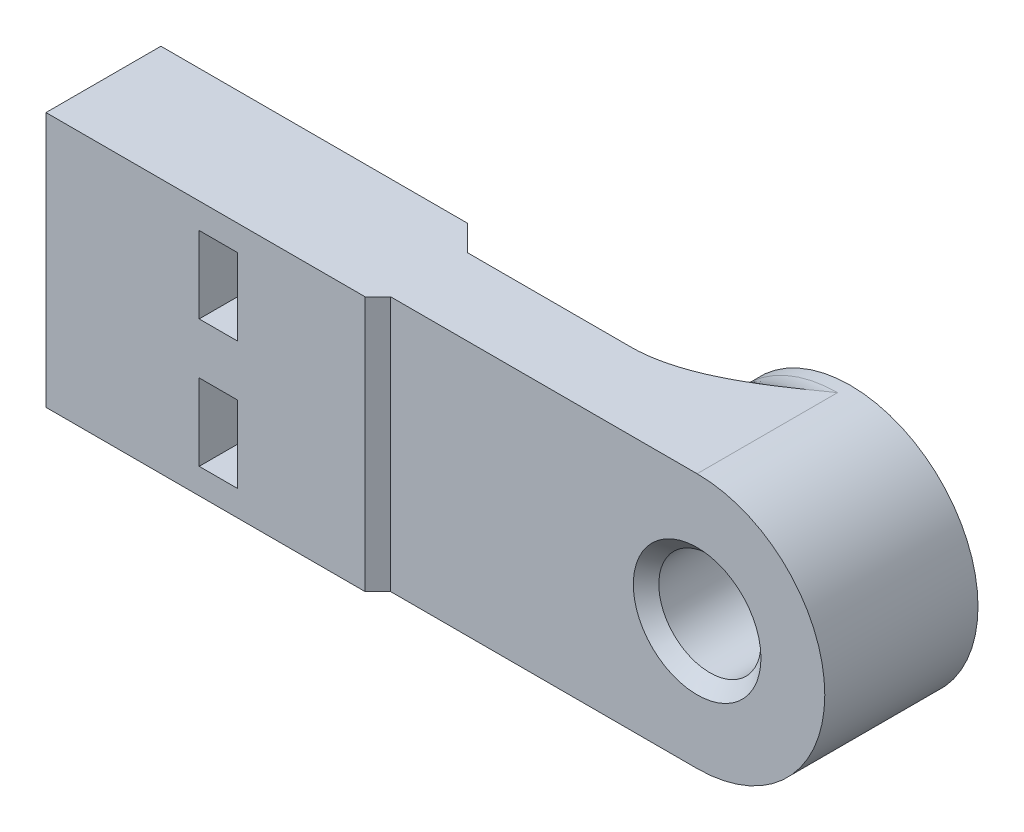
ISO-10303-21;
HEADER;
FILE_DESCRIPTION(('STEP AP214'),'2;1');
FILE_NAME('part.step','',(''),(''),'','','');
FILE_SCHEMA(('AUTOMOTIVE_DESIGN { 1 0 10303 214 1 1 1 1 }'));
ENDSEC;
DATA;
#1=APPLICATION_CONTEXT('core data for automotive mechanical design processes');
#2=APPLICATION_PROTOCOL_DEFINITION('international standard','automotive_design',2000,#1);
#3=PRODUCT_CONTEXT('',#1,'mechanical');
#4=PRODUCT('Part','Part','',(#3));
#5=PRODUCT_RELATED_PRODUCT_CATEGORY('part','',(#4));
#6=PRODUCT_DEFINITION_FORMATION('','',#4);
#7=PRODUCT_DEFINITION_CONTEXT('part definition',#1,'design');
#8=PRODUCT_DEFINITION('design','',#6,#7);
#9=PRODUCT_DEFINITION_SHAPE('','',#8);
#10=(LENGTH_UNIT() NAMED_UNIT(*) SI_UNIT(.MILLI.,.METRE.));
#11=(NAMED_UNIT(*) PLANE_ANGLE_UNIT() SI_UNIT($,.RADIAN.));
#12=(NAMED_UNIT(*) SI_UNIT($,.STERADIAN.) SOLID_ANGLE_UNIT());
#13=UNCERTAINTY_MEASURE_WITH_UNIT(LENGTH_MEASURE(1.E-05),#10,'distance_accuracy_value','');
#14=(GEOMETRIC_REPRESENTATION_CONTEXT(3) GLOBAL_UNCERTAINTY_ASSIGNED_CONTEXT((#13)) GLOBAL_UNIT_ASSIGNED_CONTEXT((#10,
#11,#12)) REPRESENTATION_CONTEXT('',''));
#15=CARTESIAN_POINT('',(0.,0.,0.));
#16=DIRECTION('',(0.,0.,1.));
#17=DIRECTION('',(1.,0.,0.));
#18=AXIS2_PLACEMENT_3D('',#15,#16,#17);
#19=CARTESIAN_POINT('',(-30.,5.,2.2));
#20=DIRECTION('',(-1.,0.,0.));
#21=DIRECTION('',(0.,0.,1.));
#22=AXIS2_PLACEMENT_3D('',#19,#20,#21);
#23=CYLINDRICAL_SURFACE('',#22,1.5);
#24=CARTESIAN_POINT('',(-38.,5.,2.2));
#25=DIRECTION('',(-1.,0.,0.));
#26=DIRECTION('',(0.,0.,1.));
#27=AXIS2_PLACEMENT_3D('',#24,#25,#26);
#28=CIRCLE('',#27,1.5);
#29=CARTESIAN_POINT('',(-38.,5.,3.7));
#30=VERTEX_POINT('',#29);
#31=EDGE_CURVE('E209',#30,#30,#28,.F.);
#32=ORIENTED_EDGE('',*,*,#31,.T.);
#33=EDGE_LOOP('',(#32));
#34=FACE_BOUND('',#33,.T.);
#35=CARTESIAN_POINT('',(-50.,5.,2.2));
#36=DIRECTION('',(-1.,0.,0.));
#37=DIRECTION('',(0.,0.,1.));
#38=AXIS2_PLACEMENT_3D('',#35,#36,#37);
#39=CIRCLE('',#38,1.5);
#40=CARTESIAN_POINT('',(-50.,5.,3.7));
#41=VERTEX_POINT('',#40);
#42=EDGE_CURVE('E294',#41,#41,#39,.T.);
#43=ORIENTED_EDGE('',*,*,#42,.T.);
#44=EDGE_LOOP('',(#43));
#45=FACE_BOUND('',#44,.T.);
#46=ADVANCED_FACE('F38',(#34,#45),#23,.F.);
#47=CARTESIAN_POINT('',(-30.,-5.,2.2));
#48=DIRECTION('',(-1.,0.,0.));
#49=DIRECTION('',(0.,0.,1.));
#50=AXIS2_PLACEMENT_3D('',#47,#48,#49);
#51=CYLINDRICAL_SURFACE('',#50,1.5);
#52=CARTESIAN_POINT('',(-38.,-5.,2.2));
#53=DIRECTION('',(-1.,0.,0.));
#54=DIRECTION('',(0.,0.,1.));
#55=AXIS2_PLACEMENT_3D('',#52,#53,#54);
#56=CIRCLE('',#55,1.5);
#57=CARTESIAN_POINT('',(-38.,-5.,3.7));
#58=VERTEX_POINT('',#57);
#59=EDGE_CURVE('E247',#58,#58,#56,.F.);
#60=ORIENTED_EDGE('',*,*,#59,.T.);
#61=EDGE_LOOP('',(#60));
#62=FACE_BOUND('',#61,.T.);
#63=CARTESIAN_POINT('',(-50.,-5.,2.2));
#64=DIRECTION('',(-1.,0.,0.));
#65=DIRECTION('',(0.,0.,1.));
#66=AXIS2_PLACEMENT_3D('',#63,#64,#65);
#67=CIRCLE('',#66,1.5);
#68=CARTESIAN_POINT('',(-50.,-5.,3.7));
#69=VERTEX_POINT('',#68);
#70=EDGE_CURVE('E290',#69,#69,#67,.T.);
#71=ORIENTED_EDGE('',*,*,#70,.T.);
#72=EDGE_LOOP('',(#71));
#73=FACE_BOUND('',#72,.T.);
#74=ADVANCED_FACE('F366',(#62,#73),#51,.F.);
#75=CARTESIAN_POINT('',(0.,0.,6.));
#76=DIRECTION('',(0.,0.,1.));
#77=DIRECTION('',(1.,0.,0.));
#78=AXIS2_PLACEMENT_3D('',#75,#76,#77);
#79=PLANE('',#78);
#80=CARTESIAN_POINT('',(0.,0.,6.));
#81=DIRECTION('',(0.,0.,1.));
#82=DIRECTION('',(1.,0.,0.));
#83=AXIS2_PLACEMENT_3D('',#80,#81,#82);
#84=CIRCLE('',#83,4.99999999999999);
#85=CARTESIAN_POINT('',(4.99999999999999,0.,6.));
#86=VERTEX_POINT('',#85);
#87=EDGE_CURVE('E326',#86,#86,#84,.F.);
#88=ORIENTED_EDGE('',*,*,#87,.T.);
#89=EDGE_LOOP('',(#88));
#90=FACE_BOUND('',#89,.T.);
#91=DIRECTION('',(-1.,0.,0.));
#92=VECTOR('',#91,1.);
#93=CARTESIAN_POINT('',(0.,10.,6.));
#94=LINE('',#93,#92);
#95=CARTESIAN_POINT('',(0.,10.,6.));
#96=VERTEX_POINT('',#95);
#97=CARTESIAN_POINT('',(-24.,10.,6.));
#98=VERTEX_POINT('',#97);
#99=EDGE_CURVE('E309',#96,#98,#94,.T.);
#100=ORIENTED_EDGE('',*,*,#99,.T.);
#101=DIRECTION('',(0.,-1.,0.));
#102=VECTOR('',#101,1.);
#103=CARTESIAN_POINT('',(-24.,10.,6.));
#104=LINE('',#103,#102);
#105=CARTESIAN_POINT('',(-24.,-10.,6.));
#106=VERTEX_POINT('',#105);
#107=EDGE_CURVE('E267',#98,#106,#104,.T.);
#108=ORIENTED_EDGE('',*,*,#107,.T.);
#109=DIRECTION('',(-1.,0.,0.));
#110=VECTOR('',#109,1.);
#111=CARTESIAN_POINT('',(0.,-10.,6.));
#112=LINE('',#111,#110);
#113=CARTESIAN_POINT('',(0.,-10.,6.));
#114=VERTEX_POINT('',#113);
#115=EDGE_CURVE('E303',#114,#106,#112,.T.);
#116=ORIENTED_EDGE('',*,*,#115,.F.);
#117=CARTESIAN_POINT('',(0.,0.,6.));
#118=DIRECTION('',(0.,0.,1.));
#119=DIRECTION('',(1.,0.,0.));
#120=AXIS2_PLACEMENT_3D('',#117,#118,#119);
#121=CIRCLE('',#120,10.);
#122=EDGE_CURVE('E306',#114,#96,#121,.T.);
#123=ORIENTED_EDGE('',*,*,#122,.T.);
#124=EDGE_LOOP('',(#100,#108,#116,#123));
#125=FACE_BOUND('',#124,.T.);
#126=ADVANCED_FACE('F372',(#90,#125),#79,.T.);
#127=CARTESIAN_POINT('',(0.,0.,0.));
#128=DIRECTION('',(0.,0.,1.));
#129=DIRECTION('',(1.,0.,0.));
#130=AXIS2_PLACEMENT_3D('',#127,#128,#129);
#131=PLANE('',#130);
#132=DIRECTION('',(-1.,0.,0.));
#133=VECTOR('',#132,1.);
#134=CARTESIAN_POINT('',(0.,10.,0.));
#135=LINE('',#134,#133);
#136=CARTESIAN_POINT('',(-11.1803398874989,10.,0.));
#137=VERTEX_POINT('',#136);
#138=CARTESIAN_POINT('',(-24.,10.,0.));
#139=VERTEX_POINT('',#138);
#140=EDGE_CURVE('E307',#137,#139,#135,.T.);
#141=ORIENTED_EDGE('',*,*,#140,.F.);
#142=CARTESIAN_POINT('',(0.,0.,0.));
#143=DIRECTION('',(0.,0.,1.));
#144=DIRECTION('',(1.,0.,0.));
#145=AXIS2_PLACEMENT_3D('',#142,#143,#144);
#146=CIRCLE('',#145,15.);
#147=CARTESIAN_POINT('',(-11.1803398874989,-10.,0.));
#148=VERTEX_POINT('',#147);
#149=EDGE_CURVE('E332',#137,#148,#146,.T.);
#150=ORIENTED_EDGE('',*,*,#149,.T.);
#151=DIRECTION('',(-1.,0.,0.));
#152=VECTOR('',#151,1.);
#153=CARTESIAN_POINT('',(0.,-10.,0.));
#154=LINE('',#153,#152);
#155=CARTESIAN_POINT('',(-24.,-10.,0.));
#156=VERTEX_POINT('',#155);
#157=EDGE_CURVE('E300',#148,#156,#154,.T.);
#158=ORIENTED_EDGE('',*,*,#157,.T.);
#159=DIRECTION('',(0.,-1.,0.));
#160=VECTOR('',#159,1.);
#161=CARTESIAN_POINT('',(-24.,10.,0.));
#162=LINE('',#161,#160);
#163=EDGE_CURVE('E278',#139,#156,#162,.T.);
#164=ORIENTED_EDGE('',*,*,#163,.F.);
#165=EDGE_LOOP('',(#141,#150,#158,#164));
#166=FACE_BOUND('',#165,.T.);
#167=ADVANCED_FACE('F350',(#166),#131,.F.);
#168=CARTESIAN_POINT('',(-50.,0.,6.));
#169=DIRECTION('',(1.,0.,0.));
#170=DIRECTION('',(0.,0.,-1.));
#171=AXIS2_PLACEMENT_3D('',#168,#169,#170);
#172=PLANE('',#171);
#173=ORIENTED_EDGE('',*,*,#70,.F.);
#174=EDGE_LOOP('',(#173));
#175=FACE_BOUND('',#174,.T.);
#176=ORIENTED_EDGE('',*,*,#42,.F.);
#177=EDGE_LOOP('',(#176));
#178=FACE_BOUND('',#177,.T.);
#179=DIRECTION('',(0.,0.,-1.));
#180=VECTOR('',#179,1.);
#181=CARTESIAN_POINT('',(-50.,10.,6.));
#182=LINE('',#181,#180);
#183=CARTESIAN_POINT('',(-50.,10.,7.));
#184=VERTEX_POINT('',#183);
#185=CARTESIAN_POINT('',(-50.,10.,-2.));
#186=VERTEX_POINT('',#185);
#187=EDGE_CURVE('E312',#184,#186,#182,.T.);
#188=ORIENTED_EDGE('',*,*,#187,.T.);
#189=DIRECTION('',(0.,-1.,0.));
#190=VECTOR('',#189,1.);
#191=CARTESIAN_POINT('',(-50.,10.,-2.));
#192=LINE('',#191,#190);
#193=CARTESIAN_POINT('',(-50.,-10.,-2.));
#194=VERTEX_POINT('',#193);
#195=EDGE_CURVE('E285',#186,#194,#192,.T.);
#196=ORIENTED_EDGE('',*,*,#195,.T.);
#197=DIRECTION('',(0.,0.,-1.));
#198=VECTOR('',#197,1.);
#199=CARTESIAN_POINT('',(-50.,-10.,6.));
#200=LINE('',#199,#198);
#201=CARTESIAN_POINT('',(-50.,-10.,7.));
#202=VERTEX_POINT('',#201);
#203=EDGE_CURVE('E318',#202,#194,#200,.T.);
#204=ORIENTED_EDGE('',*,*,#203,.F.);
#205=DIRECTION('',(0.,-1.,0.));
#206=VECTOR('',#205,1.);
#207=CARTESIAN_POINT('',(-50.,10.,7.));
#208=LINE('',#207,#206);
#209=EDGE_CURVE('E264',#184,#202,#208,.T.);
#210=ORIENTED_EDGE('',*,*,#209,.F.);
#211=EDGE_LOOP('',(#188,#196,#204,#210));
#212=FACE_BOUND('',#211,.T.);
#213=ADVANCED_FACE('F346',(#175,#178,#212),#172,.F.);
#214=CARTESIAN_POINT('',(0.,-10.,6.));
#215=DIRECTION('',(0.,-1.,0.));
#216=DIRECTION('',(0.,0.,-1.));
#217=AXIS2_PLACEMENT_3D('',#214,#215,#216);
#218=PLANE('',#217);
#219=ORIENTED_EDGE('',*,*,#157,.F.);
#220=CARTESIAN_POINT('',(-11.1803398874989,-10.,0.));
#221=CARTESIAN_POINT('',(-10.8833418810393,-10.,-2.99623992574208E-05));
#222=CARTESIAN_POINT('',(-10.586723603073,-10.,-0.0146927876896592));
#223=CARTESIAN_POINT('',(-9.99650368330956,-10.,-0.0702146909149152));
#224=CARTESIAN_POINT('',(-9.70289720409119,-10.,-0.111021452114292));
#225=CARTESIAN_POINT('',(-8.83797284787217,-10.,-0.266410914239855));
#226=CARTESIAN_POINT('',(-8.27249718229527,-10.,-0.414179804953513));
#227=CARTESIAN_POINT('',(-7.41580997338313,-10.,-0.69554811680268));
#228=CARTESIAN_POINT('',(-7.11620351047926,-10.,-0.80534043107622));
#229=CARTESIAN_POINT('',(-6.52395825241383,-10.,-1.04241229811482));
#230=CARTESIAN_POINT('',(-6.23131919380736,-10.,-1.169691188458));
#231=CARTESIAN_POINT('',(-5.36306780758415,-10.,-1.5738498936846));
#232=CARTESIAN_POINT('',(-4.79777598845155,-10.,-1.87282431176304));
#233=CARTESIAN_POINT('',(-3.68544002130766,-10.,-2.51288014690883));
#234=CARTESIAN_POINT('',(-3.13860738175162,-10.,-2.85431823345776));
#235=CARTESIAN_POINT('',(-2.06078067547005,-10.,-3.56044884205611));
#236=CARTESIAN_POINT('',(-1.52977958409396,-10.,-3.92513081814492));
#237=CARTESIAN_POINT('',(-0.672566535979616,-10.,-4.5244681553936));
#238=CARTESIAN_POINT('',(-0.344440515490625,-10.,-4.75644450116076));
#239=CARTESIAN_POINT('',(-0.0108866222774938,-10.,-4.99230199522322));
#240=CARTESIAN_POINT('',(-0.00544331176374283,-10.,-4.99615099701162));
#241=CARTESIAN_POINT('',(0.,-10.,-5.));
#242=B_SPLINE_CURVE_WITH_KNOTS('',3,(#220,#221,#222,#223,#224,#225,#226,#227,#228,#229,#230,
#231,#232,#233,#234,#235,#236,#237,#238,#239,#240,#241),.UNSPECIFIED.,.F.,.F.,(4,2,2,2,2,2,2,2,
2,2,4),(0.,0.890035292464695,1.77829507120272,3.52501481011828,4.48189649503702,
5.43874194160512,7.35450080314856,9.28760187109383,11.2198320325017,12.4253863415644,
12.4453863415646),.UNSPECIFIED.);
#243=CARTESIAN_POINT('',(0.,-10.,-5.));
#244=VERTEX_POINT('',#243);
#245=EDGE_CURVE('E51',#148,#244,#242,.T.);
#246=ORIENTED_EDGE('',*,*,#245,.T.);
#247=DIRECTION('',(0.,0.,-1.));
#248=VECTOR('',#247,1.);
#249=CARTESIAN_POINT('',(0.,-10.,6.));
#250=LINE('',#249,#248);
#251=EDGE_CURVE('E58',#114,#244,#250,.T.);
#252=ORIENTED_EDGE('',*,*,#251,.F.);
#253=ORIENTED_EDGE('',*,*,#115,.T.);
#254=DIRECTION('',(0.707106781186547,0.,-0.707106781186549));
#255=VECTOR('',#254,1.);
#256=CARTESIAN_POINT('',(-9.00000000000002,-10.,-9.));
#257=LINE('',#256,#255);
#258=CARTESIAN_POINT('',(-25.,-10.,7.));
#259=VERTEX_POINT('',#258);
#260=EDGE_CURVE('E253',#259,#106,#257,.T.);
#261=ORIENTED_EDGE('',*,*,#260,.F.);
#262=DIRECTION('',(1.,0.,0.));
#263=VECTOR('',#262,1.);
#264=CARTESIAN_POINT('',(0.,-10.,7.));
#265=LINE('',#264,#263);
#266=EDGE_CURVE('E257',#202,#259,#265,.T.);
#267=ORIENTED_EDGE('',*,*,#266,.F.);
#268=ORIENTED_EDGE('',*,*,#203,.T.);
#269=DIRECTION('',(1.,0.,0.));
#270=VECTOR('',#269,1.);
#271=CARTESIAN_POINT('',(0.,-10.,-2.));
#272=LINE('',#271,#270);
#273=CARTESIAN_POINT('',(-26.,-10.,-2.));
#274=VERTEX_POINT('',#273);
#275=EDGE_CURVE('E275',#194,#274,#272,.T.);
#276=ORIENTED_EDGE('',*,*,#275,.T.);
#277=DIRECTION('',(0.707106781186551,0.,0.707106781186544));
#278=VECTOR('',#277,1.);
#279=CARTESIAN_POINT('',(-11.9999999999999,-10.,12.));
#280=LINE('',#279,#278);
#281=EDGE_CURVE('E270',#274,#156,#280,.T.);
#282=ORIENTED_EDGE('',*,*,#281,.T.);
#283=EDGE_LOOP('',(#219,#246,#252,#253,#261,#267,#268,#276,#282));
#284=FACE_BOUND('',#283,.T.);
#285=ADVANCED_FACE('F340',(#284),#218,.T.);
#286=CARTESIAN_POINT('',(0.,0.,6.));
#287=DIRECTION('',(0.,0.,-1.));
#288=DIRECTION('',(-1.,0.,0.));
#289=AXIS2_PLACEMENT_3D('',#286,#287,#288);
#290=CYLINDRICAL_SURFACE('',#289,10.);
#291=ORIENTED_EDGE('',*,*,#251,.T.);
#292=CARTESIAN_POINT('',(0.,0.,-5.));
#293=DIRECTION('',(0.,0.,1.));
#294=DIRECTION('',(1.,0.,0.));
#295=AXIS2_PLACEMENT_3D('',#292,#293,#294);
#296=CIRCLE('',#295,10.);
#297=CARTESIAN_POINT('',(0.,10.,-5.));
#298=VERTEX_POINT('',#297);
#299=EDGE_CURVE('E335',#244,#298,#296,.F.);
#300=ORIENTED_EDGE('',*,*,#299,.T.);
#301=DIRECTION('',(0.,0.,-1.));
#302=VECTOR('',#301,1.);
#303=CARTESIAN_POINT('',(0.,10.,6.));
#304=LINE('',#303,#302);
#305=EDGE_CURVE('E65',#96,#298,#304,.T.);
#306=ORIENTED_EDGE('',*,*,#305,.F.);
#307=ORIENTED_EDGE('',*,*,#122,.F.);
#308=EDGE_LOOP('',(#291,#300,#306,#307));
#309=FACE_BOUND('',#308,.T.);
#310=CARTESIAN_POINT('',(0.,0.,-6.));
#311=DIRECTION('',(0.,0.,1.));
#312=DIRECTION('',(1.,0.,0.));
#313=AXIS2_PLACEMENT_3D('',#310,#311,#312);
#314=CIRCLE('',#313,10.);
#315=CARTESIAN_POINT('',(10.,0.,-6.));
#316=VERTEX_POINT('',#315);
#317=EDGE_CURVE('E250',#316,#316,#314,.T.);
#318=ORIENTED_EDGE('',*,*,#317,.T.);
#319=EDGE_LOOP('',(#318));
#320=FACE_BOUND('',#319,.T.);
#321=ADVANCED_FACE('F345',(#309,#320),#290,.T.);
#322=CARTESIAN_POINT('',(0.,10.,6.));
#323=DIRECTION('',(0.,-1.,0.));
#324=DIRECTION('',(0.,0.,-1.));
#325=AXIS2_PLACEMENT_3D('',#322,#323,#324);
#326=PLANE('',#325);
#327=ORIENTED_EDGE('',*,*,#305,.T.);
#328=CARTESIAN_POINT('',(-11.1803398874989,10.,0.));
#329=CARTESIAN_POINT('',(-10.8833418810393,10.,-2.99623992574208E-05));
#330=CARTESIAN_POINT('',(-10.586723603073,10.,-0.0146927876896592));
#331=CARTESIAN_POINT('',(-9.99650368330956,10.,-0.0702146909149152));
#332=CARTESIAN_POINT('',(-9.70289720409119,10.,-0.111021452114292));
#333=CARTESIAN_POINT('',(-8.83797284787217,10.,-0.266410914239855));
#334=CARTESIAN_POINT('',(-8.27249718229527,10.,-0.414179804953513));
#335=CARTESIAN_POINT('',(-7.41580997338313,10.,-0.69554811680268));
#336=CARTESIAN_POINT('',(-7.11620351047926,10.,-0.80534043107622));
#337=CARTESIAN_POINT('',(-6.52395825241383,10.,-1.04241229811482));
#338=CARTESIAN_POINT('',(-6.23131919380736,10.,-1.169691188458));
#339=CARTESIAN_POINT('',(-5.36306780758415,10.,-1.5738498936846));
#340=CARTESIAN_POINT('',(-4.79777598845155,10.,-1.87282431176304));
#341=CARTESIAN_POINT('',(-3.68544002130766,10.,-2.51288014690883));
#342=CARTESIAN_POINT('',(-3.13860738175162,10.,-2.85431823345776));
#343=CARTESIAN_POINT('',(-2.06078067547005,10.,-3.56044884205611));
#344=CARTESIAN_POINT('',(-1.52977958409396,10.,-3.92513081814492));
#345=CARTESIAN_POINT('',(-0.672566535979616,10.,-4.5244681553936));
#346=CARTESIAN_POINT('',(-0.344440515490625,10.,-4.75644450116076));
#347=CARTESIAN_POINT('',(-0.0108866222774938,10.,-4.99230199522322));
#348=CARTESIAN_POINT('',(-0.00544331176374283,10.,-4.99615099701162));
#349=CARTESIAN_POINT('',(0.,10.,-5.));
#350=B_SPLINE_CURVE_WITH_KNOTS('',3,(#328,#329,#330,#331,#332,#333,#334,#335,#336,#337,#338,
#339,#340,#341,#342,#343,#344,#345,#346,#347,#348,#349),.UNSPECIFIED.,.F.,.F.,(4,2,2,2,2,2,2,2,
2,2,4),(0.,0.890035292464695,1.77829507120272,3.52501481011828,4.48189649503702,
5.43874194160512,7.35450080314856,9.28760187109383,11.2198320325017,12.4253863415644,
12.4453863415646),.UNSPECIFIED.);
#351=EDGE_CURVE('E11',#298,#137,#350,.F.);
#352=ORIENTED_EDGE('',*,*,#351,.T.);
#353=ORIENTED_EDGE('',*,*,#140,.T.);
#354=DIRECTION('',(0.707106781186551,0.,0.707106781186544));
#355=VECTOR('',#354,1.);
#356=CARTESIAN_POINT('',(-11.9999999999999,10.,12.));
#357=LINE('',#356,#355);
#358=CARTESIAN_POINT('',(-26.,10.,-2.));
#359=VERTEX_POINT('',#358);
#360=EDGE_CURVE('E271',#359,#139,#357,.T.);
#361=ORIENTED_EDGE('',*,*,#360,.F.);
#362=DIRECTION('',(1.,0.,0.));
#363=VECTOR('',#362,1.);
#364=CARTESIAN_POINT('',(0.,10.,-2.));
#365=LINE('',#364,#363);
#366=EDGE_CURVE('E274',#186,#359,#365,.T.);
#367=ORIENTED_EDGE('',*,*,#366,.F.);
#368=ORIENTED_EDGE('',*,*,#187,.F.);
#369=DIRECTION('',(1.,0.,0.));
#370=VECTOR('',#369,1.);
#371=CARTESIAN_POINT('',(0.,10.,7.));
#372=LINE('',#371,#370);
#373=CARTESIAN_POINT('',(-25.,10.,7.));
#374=VERTEX_POINT('',#373);
#375=EDGE_CURVE('E256',#184,#374,#372,.T.);
#376=ORIENTED_EDGE('',*,*,#375,.T.);
#377=DIRECTION('',(0.707106781186547,0.,-0.707106781186549));
#378=VECTOR('',#377,1.);
#379=CARTESIAN_POINT('',(-9.00000000000002,10.,-9.));
#380=LINE('',#379,#378);
#381=EDGE_CURVE('E254',#374,#98,#380,.T.);
#382=ORIENTED_EDGE('',*,*,#381,.T.);
#383=ORIENTED_EDGE('',*,*,#99,.F.);
#384=EDGE_LOOP('',(#327,#352,#353,#361,#367,#368,#376,#382,#383));
#385=FACE_BOUND('',#384,.T.);
#386=ADVANCED_FACE('F502',(#385),#326,.F.);
#387=CARTESIAN_POINT('',(0.,0.,6.));
#388=DIRECTION('',(0.,0.,-1.));
#389=DIRECTION('',(-1.,0.,0.));
#390=AXIS2_PLACEMENT_3D('',#387,#388,#389);
#391=CYLINDRICAL_SURFACE('',#390,4.);
#392=CARTESIAN_POINT('',(0.,0.,5.00000000000001));
#393=DIRECTION('',(0.,0.,1.));
#394=DIRECTION('',(1.,0.,0.));
#395=AXIS2_PLACEMENT_3D('',#392,#393,#394);
#396=CIRCLE('',#395,4.);
#397=CARTESIAN_POINT('',(4.,0.,5.00000000000001));
#398=VERTEX_POINT('',#397);
#399=EDGE_CURVE('E323',#398,#398,#396,.T.);
#400=ORIENTED_EDGE('',*,*,#399,.T.);
#401=EDGE_LOOP('',(#400));
#402=FACE_BOUND('',#401,.T.);
#403=CARTESIAN_POINT('',(0.,0.,-4.99999999999999));
#404=DIRECTION('',(0.,0.,1.));
#405=DIRECTION('',(1.,0.,0.));
#406=AXIS2_PLACEMENT_3D('',#403,#404,#405);
#407=CIRCLE('',#406,4.);
#408=CARTESIAN_POINT('',(4.,0.,-4.99999999999999));
#409=VERTEX_POINT('',#408);
#410=EDGE_CURVE('E320',#409,#409,#407,.F.);
#411=ORIENTED_EDGE('',*,*,#410,.T.);
#412=EDGE_LOOP('',(#411));
#413=FACE_BOUND('',#412,.T.);
#414=ADVANCED_FACE('F439',(#402,#413),#391,.F.);
#415=CARTESIAN_POINT('',(-11.9999999999999,10.,12.));
#416=DIRECTION('',(0.707106781186544,0.,-0.707106781186551));
#417=DIRECTION('',(-0.707106781186551,0.,-0.707106781186544));
#418=AXIS2_PLACEMENT_3D('',#415,#416,#417);
#419=PLANE('',#418);
#420=ORIENTED_EDGE('',*,*,#281,.F.);
#421=DIRECTION('',(0.,-1.,0.));
#422=VECTOR('',#421,1.);
#423=CARTESIAN_POINT('',(-26.,10.,-2.));
#424=LINE('',#423,#422);
#425=EDGE_CURVE('E288',#359,#274,#424,.T.);
#426=ORIENTED_EDGE('',*,*,#425,.F.);
#427=ORIENTED_EDGE('',*,*,#360,.T.);
#428=ORIENTED_EDGE('',*,*,#163,.T.);
#429=EDGE_LOOP('',(#420,#426,#427,#428));
#430=FACE_BOUND('',#429,.T.);
#431=ADVANCED_FACE('F435',(#430),#419,.T.);
#432=CARTESIAN_POINT('',(0.,10.,-2.));
#433=DIRECTION('',(0.,0.,-1.));
#434=DIRECTION('',(-1.,0.,0.));
#435=AXIS2_PLACEMENT_3D('',#432,#433,#434);
#436=PLANE('',#435);
#437=DIRECTION('',(0.,1.,0.));
#438=VECTOR('',#437,1.);
#439=CARTESIAN_POINT('',(-38.,7.99999999999999,-2.));
#440=LINE('',#439,#438);
#441=CARTESIAN_POINT('',(-38.,1.99999999999999,-2.));
#442=VERTEX_POINT('',#441);
#443=CARTESIAN_POINT('',(-38.,7.99999999999999,-2.));
#444=VERTEX_POINT('',#443);
#445=EDGE_CURVE('E170',#442,#444,#440,.T.);
#446=ORIENTED_EDGE('',*,*,#445,.F.);
#447=DIRECTION('',(-1.,0.,0.));
#448=VECTOR('',#447,1.);
#449=CARTESIAN_POINT('',(-38.,1.99999999999999,-2.));
#450=LINE('',#449,#448);
#451=CARTESIAN_POINT('',(-35.,1.99999999999999,-2.));
#452=VERTEX_POINT('',#451);
#453=EDGE_CURVE('E188',#452,#442,#450,.T.);
#454=ORIENTED_EDGE('',*,*,#453,.F.);
#455=DIRECTION('',(0.,-1.,0.));
#456=VECTOR('',#455,1.);
#457=CARTESIAN_POINT('',(-35.,7.99999999999999,-2.));
#458=LINE('',#457,#456);
#459=CARTESIAN_POINT('',(-35.,7.99999999999999,-2.));
#460=VERTEX_POINT('',#459);
#461=EDGE_CURVE('E191',#460,#452,#458,.T.);
#462=ORIENTED_EDGE('',*,*,#461,.F.);
#463=DIRECTION('',(1.,0.,0.));
#464=VECTOR('',#463,1.);
#465=CARTESIAN_POINT('',(-38.,7.99999999999999,-2.));
#466=LINE('',#465,#464);
#467=EDGE_CURVE('E197',#444,#460,#466,.T.);
#468=ORIENTED_EDGE('',*,*,#467,.F.);
#469=EDGE_LOOP('',(#446,#454,#462,#468));
#470=FACE_BOUND('',#469,.T.);
#471=DIRECTION('',(0.,1.,0.));
#472=VECTOR('',#471,1.);
#473=CARTESIAN_POINT('',(-38.,-8.,-2.));
#474=LINE('',#473,#472);
#475=CARTESIAN_POINT('',(-38.,-8.,-2.));
#476=VERTEX_POINT('',#475);
#477=CARTESIAN_POINT('',(-38.,-2.,-2.));
#478=VERTEX_POINT('',#477);
#479=EDGE_CURVE('E212',#476,#478,#474,.T.);
#480=ORIENTED_EDGE('',*,*,#479,.F.);
#481=DIRECTION('',(-1.,0.,0.));
#482=VECTOR('',#481,1.);
#483=CARTESIAN_POINT('',(-38.,-8.,-2.));
#484=LINE('',#483,#482);
#485=CARTESIAN_POINT('',(-35.,-8.,-2.));
#486=VERTEX_POINT('',#485);
#487=EDGE_CURVE('E217',#486,#476,#484,.T.);
#488=ORIENTED_EDGE('',*,*,#487,.F.);
#489=DIRECTION('',(0.,-1.,0.));
#490=VECTOR('',#489,1.);
#491=CARTESIAN_POINT('',(-35.,-8.,-2.));
#492=LINE('',#491,#490);
#493=CARTESIAN_POINT('',(-35.,-2.,-2.));
#494=VERTEX_POINT('',#493);
#495=EDGE_CURVE('E231',#494,#486,#492,.T.);
#496=ORIENTED_EDGE('',*,*,#495,.F.);
#497=DIRECTION('',(1.,0.,0.));
#498=VECTOR('',#497,1.);
#499=CARTESIAN_POINT('',(-38.,-2.,-2.));
#500=LINE('',#499,#498);
#501=EDGE_CURVE('E228',#478,#494,#500,.T.);
#502=ORIENTED_EDGE('',*,*,#501,.F.);
#503=EDGE_LOOP('',(#480,#488,#496,#502));
#504=FACE_BOUND('',#503,.T.);
#505=ORIENTED_EDGE('',*,*,#275,.F.);
#506=ORIENTED_EDGE('',*,*,#195,.F.);
#507=ORIENTED_EDGE('',*,*,#366,.T.);
#508=ORIENTED_EDGE('',*,*,#425,.T.);
#509=EDGE_LOOP('',(#505,#506,#507,#508));
#510=FACE_BOUND('',#509,.T.);
#511=ADVANCED_FACE('F431',(#470,#504,#510),#436,.T.);
#512=CARTESIAN_POINT('',(-9.00000000000002,10.,-9.));
#513=DIRECTION('',(-0.707106781186549,0.,-0.707106781186547));
#514=DIRECTION('',(-0.707106781186547,0.,0.707106781186549));
#515=AXIS2_PLACEMENT_3D('',#512,#513,#514);
#516=PLANE('',#515);
#517=ORIENTED_EDGE('',*,*,#260,.T.);
#518=ORIENTED_EDGE('',*,*,#107,.F.);
#519=ORIENTED_EDGE('',*,*,#381,.F.);
#520=DIRECTION('',(0.,-1.,0.));
#521=VECTOR('',#520,1.);
#522=CARTESIAN_POINT('',(-25.,10.,7.));
#523=LINE('',#522,#521);
#524=EDGE_CURVE('E259',#374,#259,#523,.T.);
#525=ORIENTED_EDGE('',*,*,#524,.T.);
#526=EDGE_LOOP('',(#517,#518,#519,#525));
#527=FACE_BOUND('',#526,.T.);
#528=ADVANCED_FACE('F428',(#527),#516,.F.);
#529=CARTESIAN_POINT('',(0.,10.,7.));
#530=DIRECTION('',(0.,0.,-1.));
#531=DIRECTION('',(-1.,0.,0.));
#532=AXIS2_PLACEMENT_3D('',#529,#530,#531);
#533=PLANE('',#532);
#534=DIRECTION('',(-1.,0.,0.));
#535=VECTOR('',#534,1.);
#536=CARTESIAN_POINT('',(-38.,1.99999999999999,7.));
#537=LINE('',#536,#535);
#538=CARTESIAN_POINT('',(-35.,1.99999999999999,7.));
#539=VERTEX_POINT('',#538);
#540=CARTESIAN_POINT('',(-38.,1.99999999999999,7.));
#541=VERTEX_POINT('',#540);
#542=EDGE_CURVE('E175',#539,#541,#537,.T.);
#543=ORIENTED_EDGE('',*,*,#542,.T.);
#544=DIRECTION('',(0.,1.,0.));
#545=VECTOR('',#544,1.);
#546=CARTESIAN_POINT('',(-38.,7.99999999999999,7.));
#547=LINE('',#546,#545);
#548=CARTESIAN_POINT('',(-38.,7.99999999999999,7.));
#549=VERTEX_POINT('',#548);
#550=EDGE_CURVE('E167',#541,#549,#547,.T.);
#551=ORIENTED_EDGE('',*,*,#550,.T.);
#552=DIRECTION('',(1.,0.,0.));
#553=VECTOR('',#552,1.);
#554=CARTESIAN_POINT('',(-38.,7.99999999999999,7.));
#555=LINE('',#554,#553);
#556=CARTESIAN_POINT('',(-35.,7.99999999999999,7.));
#557=VERTEX_POINT('',#556);
#558=EDGE_CURVE('E179',#549,#557,#555,.T.);
#559=ORIENTED_EDGE('',*,*,#558,.T.);
#560=DIRECTION('',(0.,-1.,0.));
#561=VECTOR('',#560,1.);
#562=CARTESIAN_POINT('',(-35.,7.99999999999999,7.));
#563=LINE('',#562,#561);
#564=EDGE_CURVE('E183',#557,#539,#563,.T.);
#565=ORIENTED_EDGE('',*,*,#564,.T.);
#566=EDGE_LOOP('',(#543,#551,#559,#565));
#567=FACE_BOUND('',#566,.T.);
#568=DIRECTION('',(-1.,0.,0.));
#569=VECTOR('',#568,1.);
#570=CARTESIAN_POINT('',(-38.,-8.,7.));
#571=LINE('',#570,#569);
#572=CARTESIAN_POINT('',(-35.,-8.,7.));
#573=VERTEX_POINT('',#572);
#574=CARTESIAN_POINT('',(-38.,-8.,7.));
#575=VERTEX_POINT('',#574);
#576=EDGE_CURVE('E223',#573,#575,#571,.T.);
#577=ORIENTED_EDGE('',*,*,#576,.T.);
#578=DIRECTION('',(0.,1.,0.));
#579=VECTOR('',#578,1.);
#580=CARTESIAN_POINT('',(-38.,-8.,7.));
#581=LINE('',#580,#579);
#582=CARTESIAN_POINT('',(-38.,-2.,7.));
#583=VERTEX_POINT('',#582);
#584=EDGE_CURVE('E213',#575,#583,#581,.T.);
#585=ORIENTED_EDGE('',*,*,#584,.T.);
#586=DIRECTION('',(1.,0.,0.));
#587=VECTOR('',#586,1.);
#588=CARTESIAN_POINT('',(-38.,-2.,7.));
#589=LINE('',#588,#587);
#590=CARTESIAN_POINT('',(-35.,-2.,7.));
#591=VERTEX_POINT('',#590);
#592=EDGE_CURVE('E216',#583,#591,#589,.T.);
#593=ORIENTED_EDGE('',*,*,#592,.T.);
#594=DIRECTION('',(0.,-1.,0.));
#595=VECTOR('',#594,1.);
#596=CARTESIAN_POINT('',(-35.,-8.,7.));
#597=LINE('',#596,#595);
#598=EDGE_CURVE('E220',#591,#573,#597,.T.);
#599=ORIENTED_EDGE('',*,*,#598,.T.);
#600=EDGE_LOOP('',(#577,#585,#593,#599));
#601=FACE_BOUND('',#600,.T.);
#602=ORIENTED_EDGE('',*,*,#266,.T.);
#603=ORIENTED_EDGE('',*,*,#524,.F.);
#604=ORIENTED_EDGE('',*,*,#375,.F.);
#605=ORIENTED_EDGE('',*,*,#209,.T.);
#606=EDGE_LOOP('',(#602,#603,#604,#605));
#607=FACE_BOUND('',#606,.T.);
#608=ADVANCED_FACE('F185',(#567,#601,#607),#533,.F.);
#609=CARTESIAN_POINT('',(0.,0.,-6.));
#610=DIRECTION('',(0.,0.,1.));
#611=DIRECTION('',(1.,0.,0.));
#612=AXIS2_PLACEMENT_3D('',#609,#610,#611);
#613=PLANE('',#612);
#614=CARTESIAN_POINT('',(0.,0.,-6.));
#615=DIRECTION('',(0.,0.,1.));
#616=DIRECTION('',(1.,0.,0.));
#617=AXIS2_PLACEMENT_3D('',#614,#615,#616);
#618=CIRCLE('',#617,5.);
#619=CARTESIAN_POINT('',(5.,0.,-6.));
#620=VERTEX_POINT('',#619);
#621=EDGE_CURVE('E329',#620,#620,#618,.T.);
#622=ORIENTED_EDGE('',*,*,#621,.T.);
#623=EDGE_LOOP('',(#622));
#624=FACE_BOUND('',#623,.T.);
#625=ORIENTED_EDGE('',*,*,#317,.F.);
#626=EDGE_LOOP('',(#625));
#627=FACE_BOUND('',#626,.T.);
#628=ADVANCED_FACE('F421',(#624,#627),#613,.F.);
#629=CARTESIAN_POINT('',(-38.,-8.,7.));
#630=DIRECTION('',(-1.,0.,0.));
#631=DIRECTION('',(0.,0.,1.));
#632=AXIS2_PLACEMENT_3D('',#629,#630,#631);
#633=PLANE('',#632);
#634=ORIENTED_EDGE('',*,*,#479,.T.);
#635=DIRECTION('',(0.,0.,-1.));
#636=VECTOR('',#635,1.);
#637=CARTESIAN_POINT('',(-38.,-2.,7.));
#638=LINE('',#637,#636);
#639=EDGE_CURVE('E226',#583,#478,#638,.T.);
#640=ORIENTED_EDGE('',*,*,#639,.F.);
#641=ORIENTED_EDGE('',*,*,#584,.F.);
#642=DIRECTION('',(0.,0.,-1.));
#643=VECTOR('',#642,1.);
#644=CARTESIAN_POINT('',(-38.,-8.,7.));
#645=LINE('',#644,#643);
#646=EDGE_CURVE('E236',#575,#476,#645,.T.);
#647=ORIENTED_EDGE('',*,*,#646,.T.);
#648=EDGE_LOOP('',(#634,#640,#641,#647));
#649=FACE_BOUND('',#648,.T.);
#650=ORIENTED_EDGE('',*,*,#59,.F.);
#651=EDGE_LOOP('',(#650));
#652=FACE_BOUND('',#651,.T.);
#653=ADVANCED_FACE('F413',(#649,#652),#633,.F.);
#654=CARTESIAN_POINT('',(-35.,-8.,7.));
#655=DIRECTION('',(1.,0.,0.));
#656=DIRECTION('',(0.,0.,-1.));
#657=AXIS2_PLACEMENT_3D('',#654,#655,#656);
#658=PLANE('',#657);
#659=ORIENTED_EDGE('',*,*,#495,.T.);
#660=DIRECTION('',(0.,0.,-1.));
#661=VECTOR('',#660,1.);
#662=CARTESIAN_POINT('',(-35.,-8.,7.));
#663=LINE('',#662,#661);
#664=EDGE_CURVE('E239',#573,#486,#663,.T.);
#665=ORIENTED_EDGE('',*,*,#664,.F.);
#666=ORIENTED_EDGE('',*,*,#598,.F.);
#667=DIRECTION('',(0.,0.,-1.));
#668=VECTOR('',#667,1.);
#669=CARTESIAN_POINT('',(-35.,-2.,7.));
#670=LINE('',#669,#668);
#671=EDGE_CURVE('E241',#591,#494,#670,.T.);
#672=ORIENTED_EDGE('',*,*,#671,.T.);
#673=EDGE_LOOP('',(#659,#665,#666,#672));
#674=FACE_BOUND('',#673,.T.);
#675=CARTESIAN_POINT('',(-35.,-5.,2.2));
#676=DIRECTION('',(1.,0.,0.));
#677=DIRECTION('',(0.,0.,-1.));
#678=AXIS2_PLACEMENT_3D('',#675,#676,#677);
#679=CIRCLE('',#678,1.5);
#680=CARTESIAN_POINT('',(-35.,-5.,0.700000000000002));
#681=VERTEX_POINT('',#680);
#682=EDGE_CURVE('E238',#681,#681,#679,.F.);
#683=ORIENTED_EDGE('',*,*,#682,.F.);
#684=EDGE_LOOP('',(#683));
#685=FACE_BOUND('',#684,.T.);
#686=ADVANCED_FACE('F409',(#674,#685),#658,.F.);
#687=CARTESIAN_POINT('',(-38.,-8.,7.));
#688=DIRECTION('',(0.,-1.,0.));
#689=DIRECTION('',(0.,0.,-1.));
#690=AXIS2_PLACEMENT_3D('',#687,#688,#689);
#691=PLANE('',#690);
#692=ORIENTED_EDGE('',*,*,#487,.T.);
#693=ORIENTED_EDGE('',*,*,#646,.F.);
#694=ORIENTED_EDGE('',*,*,#576,.F.);
#695=ORIENTED_EDGE('',*,*,#664,.T.);
#696=EDGE_LOOP('',(#692,#693,#694,#695));
#697=FACE_BOUND('',#696,.T.);
#698=ADVANCED_FACE('F405',(#697),#691,.F.);
#699=CARTESIAN_POINT('',(-38.,-2.,7.));
#700=DIRECTION('',(0.,1.,0.));
#701=DIRECTION('',(0.,0.,1.));
#702=AXIS2_PLACEMENT_3D('',#699,#700,#701);
#703=PLANE('',#702);
#704=ORIENTED_EDGE('',*,*,#501,.T.);
#705=ORIENTED_EDGE('',*,*,#671,.F.);
#706=ORIENTED_EDGE('',*,*,#592,.F.);
#707=ORIENTED_EDGE('',*,*,#639,.T.);
#708=EDGE_LOOP('',(#704,#705,#706,#707));
#709=FACE_BOUND('',#708,.T.);
#710=ADVANCED_FACE('F408',(#709),#703,.F.);
#711=CARTESIAN_POINT('',(-30.,0.,0.));
#712=DIRECTION('',(-1.,0.,0.));
#713=DIRECTION('',(0.,0.,1.));
#714=AXIS2_PLACEMENT_3D('',#711,#712,#713);
#715=PLANE('',#714);
#716=CARTESIAN_POINT('',(-30.,-5.,2.2));
#717=DIRECTION('',(-1.,0.,0.));
#718=DIRECTION('',(0.,0.,1.));
#719=AXIS2_PLACEMENT_3D('',#716,#717,#718);
#720=CIRCLE('',#719,1.5);
#721=CARTESIAN_POINT('',(-30.,-5.,3.7));
#722=VERTEX_POINT('',#721);
#723=EDGE_CURVE('E291',#722,#722,#720,.T.);
#724=ORIENTED_EDGE('',*,*,#723,.T.);
#725=EDGE_LOOP('',(#724));
#726=FACE_BOUND('',#725,.T.);
#727=ADVANCED_FACE('F417',(#726),#715,.T.);
#728=ORIENTED_EDGE('',*,*,#682,.T.);
#729=EDGE_LOOP('',(#728));
#730=FACE_BOUND('',#729,.T.);
#731=ORIENTED_EDGE('',*,*,#723,.F.);
#732=EDGE_LOOP('',(#731));
#733=FACE_BOUND('',#732,.T.);
#734=ADVANCED_FACE('F375',(#730,#733),#51,.F.);
#735=CARTESIAN_POINT('',(-38.,7.99999999999999,7.));
#736=DIRECTION('',(-1.,0.,0.));
#737=DIRECTION('',(0.,0.,1.));
#738=AXIS2_PLACEMENT_3D('',#735,#736,#737);
#739=PLANE('',#738);
#740=ORIENTED_EDGE('',*,*,#445,.T.);
#741=DIRECTION('',(0.,0.,-1.));
#742=VECTOR('',#741,1.);
#743=CARTESIAN_POINT('',(-38.,7.99999999999999,7.));
#744=LINE('',#743,#742);
#745=EDGE_CURVE('E162',#549,#444,#744,.T.);
#746=ORIENTED_EDGE('',*,*,#745,.F.);
#747=ORIENTED_EDGE('',*,*,#550,.F.);
#748=DIRECTION('',(0.,0.,-1.));
#749=VECTOR('',#748,1.);
#750=CARTESIAN_POINT('',(-38.,1.99999999999999,7.));
#751=LINE('',#750,#749);
#752=EDGE_CURVE('E201',#541,#442,#751,.T.);
#753=ORIENTED_EDGE('',*,*,#752,.T.);
#754=EDGE_LOOP('',(#740,#746,#747,#753));
#755=FACE_BOUND('',#754,.T.);
#756=ORIENTED_EDGE('',*,*,#31,.F.);
#757=EDGE_LOOP('',(#756));
#758=FACE_BOUND('',#757,.T.);
#759=ADVANCED_FACE('F164',(#755,#758),#739,.F.);
#760=CARTESIAN_POINT('',(-35.,7.99999999999999,7.));
#761=DIRECTION('',(1.,0.,0.));
#762=DIRECTION('',(0.,0.,-1.));
#763=AXIS2_PLACEMENT_3D('',#760,#761,#762);
#764=PLANE('',#763);
#765=ORIENTED_EDGE('',*,*,#461,.T.);
#766=DIRECTION('',(0.,0.,-1.));
#767=VECTOR('',#766,1.);
#768=CARTESIAN_POINT('',(-35.,1.99999999999999,7.));
#769=LINE('',#768,#767);
#770=EDGE_CURVE('E204',#539,#452,#769,.T.);
#771=ORIENTED_EDGE('',*,*,#770,.F.);
#772=ORIENTED_EDGE('',*,*,#564,.F.);
#773=DIRECTION('',(0.,0.,-1.));
#774=VECTOR('',#773,1.);
#775=CARTESIAN_POINT('',(-35.,7.99999999999999,7.));
#776=LINE('',#775,#774);
#777=EDGE_CURVE('E174',#557,#460,#776,.T.);
#778=ORIENTED_EDGE('',*,*,#777,.T.);
#779=EDGE_LOOP('',(#765,#771,#772,#778));
#780=FACE_BOUND('',#779,.T.);
#781=CARTESIAN_POINT('',(-35.,5.,2.2));
#782=DIRECTION('',(1.,0.,0.));
#783=DIRECTION('',(0.,0.,-1.));
#784=AXIS2_PLACEMENT_3D('',#781,#782,#783);
#785=CIRCLE('',#784,1.5);
#786=CARTESIAN_POINT('',(-35.,5.,0.700000000000002));
#787=VERTEX_POINT('',#786);
#788=EDGE_CURVE('E203',#787,#787,#785,.F.);
#789=ORIENTED_EDGE('',*,*,#788,.F.);
#790=EDGE_LOOP('',(#789));
#791=FACE_BOUND('',#790,.T.);
#792=ADVANCED_FACE('F390',(#780,#791),#764,.F.);
#793=CARTESIAN_POINT('',(-38.,1.99999999999999,7.));
#794=DIRECTION('',(0.,-1.,0.));
#795=DIRECTION('',(1.,0.,0.));
#796=AXIS2_PLACEMENT_3D('',#793,#794,#795);
#797=PLANE('',#796);
#798=ORIENTED_EDGE('',*,*,#453,.T.);
#799=ORIENTED_EDGE('',*,*,#752,.F.);
#800=ORIENTED_EDGE('',*,*,#542,.F.);
#801=ORIENTED_EDGE('',*,*,#770,.T.);
#802=EDGE_LOOP('',(#798,#799,#800,#801));
#803=FACE_BOUND('',#802,.T.);
#804=ADVANCED_FACE('F392',(#803),#797,.F.);
#805=CARTESIAN_POINT('',(-38.,7.99999999999999,7.));
#806=DIRECTION('',(0.,1.,0.));
#807=DIRECTION('',(0.,0.,1.));
#808=AXIS2_PLACEMENT_3D('',#805,#806,#807);
#809=PLANE('',#808);
#810=ORIENTED_EDGE('',*,*,#467,.T.);
#811=ORIENTED_EDGE('',*,*,#777,.F.);
#812=ORIENTED_EDGE('',*,*,#558,.F.);
#813=ORIENTED_EDGE('',*,*,#745,.T.);
#814=EDGE_LOOP('',(#810,#811,#812,#813));
#815=FACE_BOUND('',#814,.T.);
#816=ADVANCED_FACE('F180',(#815),#809,.F.);
#817=CARTESIAN_POINT('',(-30.,0.,0.));
#818=DIRECTION('',(-1.,0.,0.));
#819=DIRECTION('',(0.,0.,1.));
#820=AXIS2_PLACEMENT_3D('',#817,#818,#819);
#821=PLANE('',#820);
#822=CARTESIAN_POINT('',(-30.,5.,2.2));
#823=DIRECTION('',(-1.,0.,0.));
#824=DIRECTION('',(0.,0.,1.));
#825=AXIS2_PLACEMENT_3D('',#822,#823,#824);
#826=CIRCLE('',#825,1.5);
#827=CARTESIAN_POINT('',(-30.,5.,3.7));
#828=VERTEX_POINT('',#827);
#829=EDGE_CURVE('E297',#828,#828,#826,.T.);
#830=ORIENTED_EDGE('',*,*,#829,.T.);
#831=EDGE_LOOP('',(#830));
#832=FACE_BOUND('',#831,.T.);
#833=ADVANCED_FACE('F380',(#832),#821,.T.);
#834=ORIENTED_EDGE('',*,*,#788,.T.);
#835=EDGE_LOOP('',(#834));
#836=FACE_BOUND('',#835,.T.);
#837=ORIENTED_EDGE('',*,*,#829,.F.);
#838=EDGE_LOOP('',(#837));
#839=FACE_BOUND('',#838,.T.);
#840=ADVANCED_FACE('F355',(#836,#839),#23,.F.);
#841=CARTESIAN_POINT('',(0.,0.,5.00000000000001));
#842=DIRECTION('',(0.,0.,1.));
#843=DIRECTION('',(1.,0.,0.));
#844=AXIS2_PLACEMENT_3D('',#841,#842,#843);
#845=CONICAL_SURFACE('',#844,4.,0.785398163397448);
#846=ORIENTED_EDGE('',*,*,#87,.F.);
#847=EDGE_LOOP('',(#846));
#848=FACE_BOUND('',#847,.T.);
#849=ORIENTED_EDGE('',*,*,#399,.F.);
#850=EDGE_LOOP('',(#849));
#851=FACE_BOUND('',#850,.T.);
#852=ADVANCED_FACE('F352',(#848,#851),#845,.F.);
#853=CARTESIAN_POINT('',(0.,0.,-6.));
#854=DIRECTION('',(0.,0.,-1.));
#855=DIRECTION('',(-1.,0.,0.));
#856=AXIS2_PLACEMENT_3D('',#853,#854,#855);
#857=CONICAL_SURFACE('',#856,5.,0.785398163397441);
#858=ORIENTED_EDGE('',*,*,#410,.F.);
#859=EDGE_LOOP('',(#858));
#860=FACE_BOUND('',#859,.T.);
#861=ORIENTED_EDGE('',*,*,#621,.F.);
#862=EDGE_LOOP('',(#861));
#863=FACE_BOUND('',#862,.T.);
#864=ADVANCED_FACE('F354',(#860,#863),#857,.F.);
#865=CARTESIAN_POINT('',(0.,0.,-5.));
#866=DIRECTION('',(0.,0.,1.));
#867=DIRECTION('',(1.,0.,0.));
#868=AXIS2_PLACEMENT_3D('',#865,#866,#867);
#869=TOROIDAL_SURFACE('',#868,15.,5.);
#870=ORIENTED_EDGE('',*,*,#351,.F.);
#871=ORIENTED_EDGE('',*,*,#299,.F.);
#872=ORIENTED_EDGE('',*,*,#245,.F.);
#873=ORIENTED_EDGE('',*,*,#149,.F.);
#874=EDGE_LOOP('',(#870,#871,#872,#873));
#875=FACE_BOUND('',#874,.T.);
#876=ADVANCED_FACE('F40',(#875),#869,.F.);
#877=CLOSED_SHELL('',(#46,#74,#126,#167,#213,#285,#321,#386,#414,#431,#511,#528,#608,#628,#653,
#686,#698,#710,#727,#734,#759,#792,#804,#816,#833,#840,#852,#864,#876));
#878=MANIFOLD_SOLID_BREP('B2',#877);
#879=ADVANCED_BREP_SHAPE_REPRESENTATION('',(#18,#878),#14);
#880=SHAPE_DEFINITION_REPRESENTATION(#9,#879);
ENDSEC;
END-ISO-10303-21;
